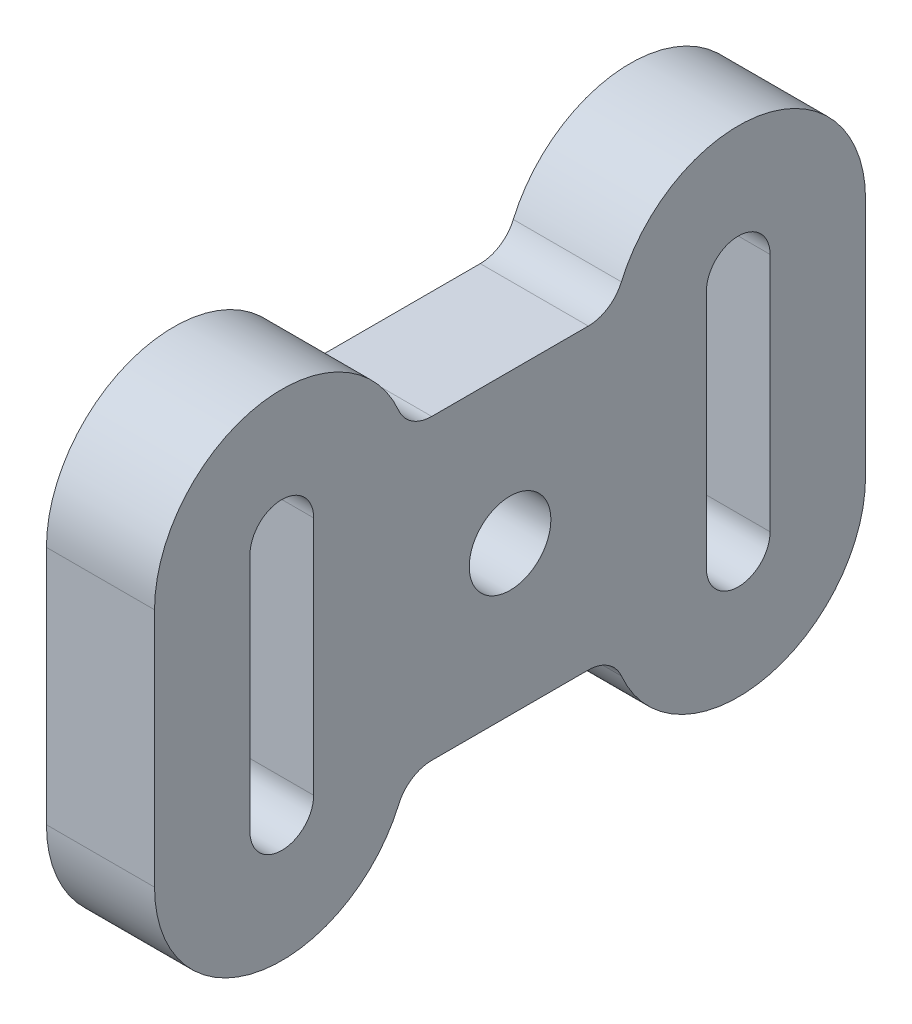
ISO-10303-21;
HEADER;
FILE_DESCRIPTION(('STEP AP214'),'2;1');
FILE_NAME('part.step','',(''),(''),'','','');
FILE_SCHEMA(('AUTOMOTIVE_DESIGN { 1 0 10303 214 1 1 1 1 }'));
ENDSEC;
DATA;
#1=APPLICATION_CONTEXT('core data for automotive mechanical design processes');
#2=APPLICATION_PROTOCOL_DEFINITION('international standard','automotive_design',2000,#1);
#3=PRODUCT_CONTEXT('',#1,'mechanical');
#4=PRODUCT('Part','Part','',(#3));
#5=PRODUCT_RELATED_PRODUCT_CATEGORY('part','',(#4));
#6=PRODUCT_DEFINITION_FORMATION('','',#4);
#7=PRODUCT_DEFINITION_CONTEXT('part definition',#1,'design');
#8=PRODUCT_DEFINITION('design','',#6,#7);
#9=PRODUCT_DEFINITION_SHAPE('','',#8);
#10=(LENGTH_UNIT() NAMED_UNIT(*) SI_UNIT(.MILLI.,.METRE.));
#11=(NAMED_UNIT(*) PLANE_ANGLE_UNIT() SI_UNIT($,.RADIAN.));
#12=(NAMED_UNIT(*) SI_UNIT($,.STERADIAN.) SOLID_ANGLE_UNIT());
#13=UNCERTAINTY_MEASURE_WITH_UNIT(LENGTH_MEASURE(1.E-05),#10,'distance_accuracy_value','');
#14=(GEOMETRIC_REPRESENTATION_CONTEXT(3) GLOBAL_UNCERTAINTY_ASSIGNED_CONTEXT((#13)) GLOBAL_UNIT_ASSIGNED_CONTEXT((#10,
#11,#12)) REPRESENTATION_CONTEXT('',''));
#15=CARTESIAN_POINT('',(0.,0.,0.));
#16=DIRECTION('',(0.,0.,1.));
#17=DIRECTION('',(1.,0.,0.));
#18=AXIS2_PLACEMENT_3D('',#15,#16,#17);
#19=CARTESIAN_POINT('',(-5.9,0.,-13.1));
#20=DIRECTION('',(1.,0.,0.));
#21=DIRECTION('',(0.,1.,0.));
#22=AXIS2_PLACEMENT_3D('',#19,#20,#21);
#23=PLANE('',#22);
#24=CARTESIAN_POINT('',(-5.9,-10.,-19.));
#25=DIRECTION('',(1.,0.,0.));
#26=DIRECTION('',(0.,0.,1.));
#27=AXIS2_PLACEMENT_3D('',#24,#25,#26);
#28=CIRCLE('',#27,2.65);
#29=CARTESIAN_POINT('',(-5.9,-10.,-16.35));
#30=VERTEX_POINT('',#29);
#31=CARTESIAN_POINT('',(-5.9,-10.,-21.65));
#32=VERTEX_POINT('',#31);
#33=EDGE_CURVE('E375',#30,#32,#28,.T.);
#34=ORIENTED_EDGE('',*,*,#33,.T.);
#35=DIRECTION('',(0.,1.,0.));
#36=VECTOR('',#35,1.);
#37=CARTESIAN_POINT('',(-5.9,0.,-21.65));
#38=LINE('',#37,#36);
#39=CARTESIAN_POINT('',(-5.9,10.,-21.65));
#40=VERTEX_POINT('',#39);
#41=EDGE_CURVE('E358',#32,#40,#38,.T.);
#42=ORIENTED_EDGE('',*,*,#41,.T.);
#43=CARTESIAN_POINT('',(-5.9,10.,-19.));
#44=DIRECTION('',(1.,0.,0.));
#45=DIRECTION('',(0.,0.,1.));
#46=AXIS2_PLACEMENT_3D('',#43,#44,#45);
#47=CIRCLE('',#46,2.65);
#48=CARTESIAN_POINT('',(-5.9,10.,-16.35));
#49=VERTEX_POINT('',#48);
#50=EDGE_CURVE('E357',#40,#49,#47,.T.);
#51=ORIENTED_EDGE('',*,*,#50,.T.);
#52=DIRECTION('',(0.,1.,0.));
#53=VECTOR('',#52,1.);
#54=CARTESIAN_POINT('',(-5.9,0.,-16.35));
#55=LINE('',#54,#53);
#56=EDGE_CURVE('E293',#30,#49,#55,.T.);
#57=ORIENTED_EDGE('',*,*,#56,.F.);
#58=EDGE_LOOP('',(#34,#42,#51,#57));
#59=FACE_BOUND('',#58,.T.);
#60=CARTESIAN_POINT('',(-5.9,10.,-19.));
#61=DIRECTION('',(1.,0.,0.));
#62=DIRECTION('',(0.,0.,1.));
#63=AXIS2_PLACEMENT_3D('',#60,#61,#62);
#64=CIRCLE('',#63,5.6);
#65=CARTESIAN_POINT('',(-5.9,10.,-24.6));
#66=VERTEX_POINT('',#65);
#67=CARTESIAN_POINT('',(-5.9,10.,-13.4));
#68=VERTEX_POINT('',#67);
#69=EDGE_CURVE('E315',#66,#68,#64,.T.);
#70=ORIENTED_EDGE('',*,*,#69,.F.);
#71=DIRECTION('',(0.,1.,0.));
#72=VECTOR('',#71,1.);
#73=CARTESIAN_POINT('',(-5.9,0.,-24.6));
#74=LINE('',#73,#72);
#75=CARTESIAN_POINT('',(-5.9,-10.,-24.6));
#76=VERTEX_POINT('',#75);
#77=EDGE_CURVE('E302',#76,#66,#74,.T.);
#78=ORIENTED_EDGE('',*,*,#77,.F.);
#79=CARTESIAN_POINT('',(-5.9,-10.,-19.));
#80=DIRECTION('',(1.,0.,0.));
#81=DIRECTION('',(0.,0.,1.));
#82=AXIS2_PLACEMENT_3D('',#79,#80,#81);
#83=CIRCLE('',#82,5.6);
#84=CARTESIAN_POINT('',(-5.9,-10.,-13.4));
#85=VERTEX_POINT('',#84);
#86=EDGE_CURVE('E28',#85,#76,#83,.T.);
#87=ORIENTED_EDGE('',*,*,#86,.F.);
#88=DIRECTION('',(0.,1.,0.));
#89=VECTOR('',#88,1.);
#90=CARTESIAN_POINT('',(-5.9,0.,-13.4));
#91=LINE('',#90,#89);
#92=EDGE_CURVE('E11',#85,#68,#91,.T.);
#93=ORIENTED_EDGE('',*,*,#92,.T.);
#94=EDGE_LOOP('',(#70,#78,#87,#93));
#95=FACE_BOUND('',#94,.T.);
#96=ADVANCED_FACE('F17',(#59,#95),#23,.F.);
#97=CARTESIAN_POINT('',(-5.9,0.,-13.4));
#98=DIRECTION('',(0.,0.,-1.));
#99=DIRECTION('',(0.,-1.,0.));
#100=AXIS2_PLACEMENT_3D('',#97,#98,#99);
#101=PLANE('',#100);
#102=DIRECTION('',(0.,1.,0.));
#103=VECTOR('',#102,1.);
#104=CARTESIAN_POINT('',(-9.,0.,-13.4));
#105=LINE('',#104,#103);
#106=CARTESIAN_POINT('',(-9.,-10.,-13.4));
#107=VERTEX_POINT('',#106);
#108=CARTESIAN_POINT('',(-9.,10.,-13.4));
#109=VERTEX_POINT('',#108);
#110=EDGE_CURVE('E346',#107,#109,#105,.T.);
#111=ORIENTED_EDGE('',*,*,#110,.T.);
#112=DIRECTION('',(-1.,0.,0.));
#113=VECTOR('',#112,1.);
#114=CARTESIAN_POINT('',(-5.9,10.,-13.4));
#115=LINE('',#114,#113);
#116=EDGE_CURVE('E318',#68,#109,#115,.T.);
#117=ORIENTED_EDGE('',*,*,#116,.F.);
#118=ORIENTED_EDGE('',*,*,#92,.F.);
#119=DIRECTION('',(-1.,0.,0.));
#120=VECTOR('',#119,1.);
#121=CARTESIAN_POINT('',(-5.9,-10.,-13.4));
#122=LINE('',#121,#120);
#123=EDGE_CURVE('E312',#85,#107,#122,.T.);
#124=ORIENTED_EDGE('',*,*,#123,.T.);
#125=EDGE_LOOP('',(#111,#117,#118,#124));
#126=FACE_BOUND('',#125,.T.);
#127=ADVANCED_FACE('F626',(#126),#101,.T.);
#128=CARTESIAN_POINT('',(-5.9,-10.,-19.));
#129=DIRECTION('',(-1.,0.,0.));
#130=DIRECTION('',(0.,0.,-1.));
#131=AXIS2_PLACEMENT_3D('',#128,#129,#130);
#132=CYLINDRICAL_SURFACE('',#131,5.6);
#133=CARTESIAN_POINT('',(-9.,-10.,-19.));
#134=DIRECTION('',(1.,0.,0.));
#135=DIRECTION('',(0.,0.,1.));
#136=AXIS2_PLACEMENT_3D('',#133,#134,#135);
#137=CIRCLE('',#136,5.6);
#138=CARTESIAN_POINT('',(-9.,-10.,-24.6));
#139=VERTEX_POINT('',#138);
#140=EDGE_CURVE('E341',#107,#139,#137,.T.);
#141=ORIENTED_EDGE('',*,*,#140,.F.);
#142=ORIENTED_EDGE('',*,*,#123,.F.);
#143=ORIENTED_EDGE('',*,*,#86,.T.);
#144=DIRECTION('',(-1.,0.,0.));
#145=VECTOR('',#144,1.);
#146=CARTESIAN_POINT('',(-5.9,-10.,-24.6));
#147=LINE('',#146,#145);
#148=EDGE_CURVE('E309',#76,#139,#147,.T.);
#149=ORIENTED_EDGE('',*,*,#148,.T.);
#150=EDGE_LOOP('',(#141,#142,#143,#149));
#151=FACE_BOUND('',#150,.T.);
#152=ADVANCED_FACE('F632',(#151),#132,.F.);
#153=CARTESIAN_POINT('',(-5.9,0.,-24.6));
#154=DIRECTION('',(0.,0.,-1.));
#155=DIRECTION('',(0.,-1.,0.));
#156=AXIS2_PLACEMENT_3D('',#153,#154,#155);
#157=PLANE('',#156);
#158=DIRECTION('',(0.,1.,0.));
#159=VECTOR('',#158,1.);
#160=CARTESIAN_POINT('',(-9.,0.,-24.6));
#161=LINE('',#160,#159);
#162=CARTESIAN_POINT('',(-9.,10.,-24.6));
#163=VERTEX_POINT('',#162);
#164=EDGE_CURVE('E345',#139,#163,#161,.T.);
#165=ORIENTED_EDGE('',*,*,#164,.F.);
#166=ORIENTED_EDGE('',*,*,#148,.F.);
#167=ORIENTED_EDGE('',*,*,#77,.T.);
#168=DIRECTION('',(-1.,0.,0.));
#169=VECTOR('',#168,1.);
#170=CARTESIAN_POINT('',(-5.9,10.,-24.6));
#171=LINE('',#170,#169);
#172=EDGE_CURVE('E307',#66,#163,#171,.T.);
#173=ORIENTED_EDGE('',*,*,#172,.T.);
#174=EDGE_LOOP('',(#165,#166,#167,#173));
#175=FACE_BOUND('',#174,.T.);
#176=ADVANCED_FACE('F305',(#175),#157,.F.);
#177=CARTESIAN_POINT('',(-5.9,10.,-19.));
#178=DIRECTION('',(-1.,0.,0.));
#179=DIRECTION('',(0.,0.,-1.));
#180=AXIS2_PLACEMENT_3D('',#177,#178,#179);
#181=CYLINDRICAL_SURFACE('',#180,5.6);
#182=CARTESIAN_POINT('',(-9.,10.,-19.));
#183=DIRECTION('',(1.,0.,0.));
#184=DIRECTION('',(0.,0.,1.));
#185=AXIS2_PLACEMENT_3D('',#182,#183,#184);
#186=CIRCLE('',#185,5.6);
#187=EDGE_CURVE('E322',#163,#109,#186,.T.);
#188=ORIENTED_EDGE('',*,*,#187,.F.);
#189=ORIENTED_EDGE('',*,*,#172,.F.);
#190=ORIENTED_EDGE('',*,*,#69,.T.);
#191=ORIENTED_EDGE('',*,*,#116,.T.);
#192=EDGE_LOOP('',(#188,#189,#190,#191));
#193=FACE_BOUND('',#192,.T.);
#194=ADVANCED_FACE('F320',(#193),#181,.F.);
#195=CARTESIAN_POINT('',(-9.,0.,-16.35));
#196=DIRECTION('',(0.,0.,1.));
#197=DIRECTION('',(1.,0.,0.));
#198=AXIS2_PLACEMENT_3D('',#195,#196,#197);
#199=PLANE('',#198);
#200=DIRECTION('',(1.,0.,0.));
#201=VECTOR('',#200,1.);
#202=CARTESIAN_POINT('',(-9.,10.,-16.35));
#203=LINE('',#202,#201);
#204=CARTESIAN_POINT('',(0.,10.,-16.35));
#205=VERTEX_POINT('',#204);
#206=EDGE_CURVE('E404',#49,#205,#203,.T.);
#207=ORIENTED_EDGE('',*,*,#206,.T.);
#208=DIRECTION('',(0.,1.,0.));
#209=VECTOR('',#208,1.);
#210=CARTESIAN_POINT('',(0.,0.,-16.35));
#211=LINE('',#210,#209);
#212=CARTESIAN_POINT('',(0.,-10.,-16.35));
#213=VERTEX_POINT('',#212);
#214=EDGE_CURVE('E428',#213,#205,#211,.T.);
#215=ORIENTED_EDGE('',*,*,#214,.F.);
#216=DIRECTION('',(1.,0.,0.));
#217=VECTOR('',#216,1.);
#218=CARTESIAN_POINT('',(-9.,-10.,-16.35));
#219=LINE('',#218,#217);
#220=EDGE_CURVE('E371',#30,#213,#219,.T.);
#221=ORIENTED_EDGE('',*,*,#220,.F.);
#222=ORIENTED_EDGE('',*,*,#56,.T.);
#223=EDGE_LOOP('',(#207,#215,#221,#222));
#224=FACE_BOUND('',#223,.T.);
#225=ADVANCED_FACE('F621',(#224),#199,.F.);
#226=CARTESIAN_POINT('',(-9.,-15.4,-6.51801297869606));
#227=DIRECTION('',(1.,0.,0.));
#228=DIRECTION('',(0.,0.,1.));
#229=AXIS2_PLACEMENT_3D('',#226,#227,#228);
#230=CYLINDRICAL_SURFACE('',#229,3.);
#231=CARTESIAN_POINT('',(0.,-15.4,-6.51801297869606));
#232=DIRECTION('',(1.,0.,0.));
#233=DIRECTION('',(0.,0.,1.));
#234=AXIS2_PLACEMENT_3D('',#231,#232,#233);
#235=CIRCLE('',#234,3.);
#236=CARTESIAN_POINT('',(0.,-14.2088235294118,-9.27139246868958));
#237=VERTEX_POINT('',#236);
#238=CARTESIAN_POINT('',(0.,-12.4,-6.51801297869606));
#239=VERTEX_POINT('',#238);
#240=EDGE_CURVE('E266',#237,#239,#235,.T.);
#241=ORIENTED_EDGE('',*,*,#240,.T.);
#242=DIRECTION('',(1.,0.,0.));
#243=VECTOR('',#242,1.);
#244=CARTESIAN_POINT('',(-9.,-12.4,-6.51801297869606));
#245=LINE('',#244,#243);
#246=CARTESIAN_POINT('',(-9.,-12.4,-6.51801297869606));
#247=VERTEX_POINT('',#246);
#248=EDGE_CURVE('E340',#247,#239,#245,.T.);
#249=ORIENTED_EDGE('',*,*,#248,.F.);
#250=CARTESIAN_POINT('',(-9.,-15.4,-6.51801297869606));
#251=DIRECTION('',(1.,0.,0.));
#252=DIRECTION('',(0.,0.,1.));
#253=AXIS2_PLACEMENT_3D('',#250,#251,#252);
#254=CIRCLE('',#253,3.);
#255=CARTESIAN_POINT('',(-9.,-14.2088235294118,-9.27139246868958));
#256=VERTEX_POINT('',#255);
#257=EDGE_CURVE('E256',#256,#247,#254,.T.);
#258=ORIENTED_EDGE('',*,*,#257,.F.);
#259=DIRECTION('',(1.,0.,0.));
#260=VECTOR('',#259,1.);
#261=CARTESIAN_POINT('',(-9.,-14.2088235294118,-9.27139246868958));
#262=LINE('',#261,#260);
#263=EDGE_CURVE('E330',#256,#237,#262,.T.);
#264=ORIENTED_EDGE('',*,*,#263,.T.);
#265=EDGE_LOOP('',(#241,#249,#258,#264));
#266=FACE_BOUND('',#265,.T.);
#267=ADVANCED_FACE('F19',(#266),#230,.F.);
#268=CARTESIAN_POINT('',(-9.,-10.,-19.));
#269=DIRECTION('',(1.,0.,0.));
#270=DIRECTION('',(0.,0.,1.));
#271=AXIS2_PLACEMENT_3D('',#268,#269,#270);
#272=CYLINDRICAL_SURFACE('',#271,10.6);
#273=CARTESIAN_POINT('',(0.,-10.,-19.));
#274=DIRECTION('',(-1.,0.,0.));
#275=DIRECTION('',(0.,0.,1.));
#276=AXIS2_PLACEMENT_3D('',#273,#274,#275);
#277=CIRCLE('',#276,10.6);
#278=CARTESIAN_POINT('',(0.,-10.,-29.6));
#279=VERTEX_POINT('',#278);
#280=EDGE_CURVE('E446',#279,#237,#277,.T.);
#281=ORIENTED_EDGE('',*,*,#280,.T.);
#282=ORIENTED_EDGE('',*,*,#263,.F.);
#283=CARTESIAN_POINT('',(-9.,-10.,-19.));
#284=DIRECTION('',(-1.,0.,0.));
#285=DIRECTION('',(0.,0.,1.));
#286=AXIS2_PLACEMENT_3D('',#283,#284,#285);
#287=CIRCLE('',#286,10.6);
#288=CARTESIAN_POINT('',(-9.,-10.,-29.6));
#289=VERTEX_POINT('',#288);
#290=EDGE_CURVE('E456',#289,#256,#287,.T.);
#291=ORIENTED_EDGE('',*,*,#290,.F.);
#292=DIRECTION('',(1.,0.,0.));
#293=VECTOR('',#292,1.);
#294=CARTESIAN_POINT('',(-9.,-10.,-29.6));
#295=LINE('',#294,#293);
#296=EDGE_CURVE('E452',#289,#279,#295,.T.);
#297=ORIENTED_EDGE('',*,*,#296,.T.);
#298=EDGE_LOOP('',(#281,#282,#291,#297));
#299=FACE_BOUND('',#298,.T.);
#300=ADVANCED_FACE('F670',(#299),#272,.T.);
#301=CARTESIAN_POINT('',(-9.,0.,-29.6));
#302=DIRECTION('',(0.,0.,-1.));
#303=DIRECTION('',(0.,-1.,0.));
#304=AXIS2_PLACEMENT_3D('',#301,#302,#303);
#305=PLANE('',#304);
#306=DIRECTION('',(0.,-1.,0.));
#307=VECTOR('',#306,1.);
#308=CARTESIAN_POINT('',(0.,0.,-29.6));
#309=LINE('',#308,#307);
#310=CARTESIAN_POINT('',(0.,10.,-29.6));
#311=VERTEX_POINT('',#310);
#312=EDGE_CURVE('E434',#311,#279,#309,.T.);
#313=ORIENTED_EDGE('',*,*,#312,.T.);
#314=ORIENTED_EDGE('',*,*,#296,.F.);
#315=DIRECTION('',(0.,-1.,0.));
#316=VECTOR('',#315,1.);
#317=CARTESIAN_POINT('',(-9.,0.,-29.6));
#318=LINE('',#317,#316);
#319=CARTESIAN_POINT('',(-9.,10.,-29.6));
#320=VERTEX_POINT('',#319);
#321=EDGE_CURVE('E482',#320,#289,#318,.T.);
#322=ORIENTED_EDGE('',*,*,#321,.F.);
#323=DIRECTION('',(1.,0.,0.));
#324=VECTOR('',#323,1.);
#325=CARTESIAN_POINT('',(-9.,10.,-29.6));
#326=LINE('',#325,#324);
#327=EDGE_CURVE('E449',#320,#311,#326,.T.);
#328=ORIENTED_EDGE('',*,*,#327,.T.);
#329=EDGE_LOOP('',(#313,#314,#322,#328));
#330=FACE_BOUND('',#329,.T.);
#331=ADVANCED_FACE('F657',(#330),#305,.T.);
#332=CARTESIAN_POINT('',(-9.,10.,-19.));
#333=DIRECTION('',(1.,0.,0.));
#334=DIRECTION('',(0.,0.,1.));
#335=AXIS2_PLACEMENT_3D('',#332,#333,#334);
#336=CYLINDRICAL_SURFACE('',#335,10.6);
#337=CARTESIAN_POINT('',(0.,10.,-19.));
#338=DIRECTION('',(-1.,0.,0.));
#339=DIRECTION('',(0.,0.,1.));
#340=AXIS2_PLACEMENT_3D('',#337,#338,#339);
#341=CIRCLE('',#340,10.6);
#342=CARTESIAN_POINT('',(0.,14.2088235294118,-9.27139246868958));
#343=VERTEX_POINT('',#342);
#344=EDGE_CURVE('E429',#343,#311,#341,.T.);
#345=ORIENTED_EDGE('',*,*,#344,.T.);
#346=ORIENTED_EDGE('',*,*,#327,.F.);
#347=CARTESIAN_POINT('',(-9.,10.,-19.));
#348=DIRECTION('',(-1.,0.,0.));
#349=DIRECTION('',(0.,0.,1.));
#350=AXIS2_PLACEMENT_3D('',#347,#348,#349);
#351=CIRCLE('',#350,10.6);
#352=CARTESIAN_POINT('',(-9.,14.2088235294118,-9.27139246868958));
#353=VERTEX_POINT('',#352);
#354=EDGE_CURVE('E463',#353,#320,#351,.T.);
#355=ORIENTED_EDGE('',*,*,#354,.F.);
#356=DIRECTION('',(1.,0.,0.));
#357=VECTOR('',#356,1.);
#358=CARTESIAN_POINT('',(-9.,14.2088235294118,-9.27139246868958));
#359=LINE('',#358,#357);
#360=EDGE_CURVE('E406',#353,#343,#359,.T.);
#361=ORIENTED_EDGE('',*,*,#360,.T.);
#362=EDGE_LOOP('',(#345,#346,#355,#361));
#363=FACE_BOUND('',#362,.T.);
#364=ADVANCED_FACE('F653',(#363),#336,.T.);
#365=CARTESIAN_POINT('',(-9.,15.4,-6.51801297869606));
#366=DIRECTION('',(1.,0.,0.));
#367=DIRECTION('',(0.,0.,1.));
#368=AXIS2_PLACEMENT_3D('',#365,#366,#367);
#369=CYLINDRICAL_SURFACE('',#368,3.);
#370=CARTESIAN_POINT('',(0.,15.4,-6.51801297869606));
#371=DIRECTION('',(-1.,0.,0.));
#372=DIRECTION('',(0.,0.,1.));
#373=AXIS2_PLACEMENT_3D('',#370,#371,#372);
#374=CIRCLE('',#373,3.);
#375=CARTESIAN_POINT('',(0.,12.4,-6.51801297869606));
#376=VERTEX_POINT('',#375);
#377=EDGE_CURVE('E433',#343,#376,#374,.T.);
#378=ORIENTED_EDGE('',*,*,#377,.F.);
#379=ORIENTED_EDGE('',*,*,#360,.F.);
#380=CARTESIAN_POINT('',(-9.,15.4,-6.51801297869606));
#381=DIRECTION('',(-1.,0.,0.));
#382=DIRECTION('',(0.,0.,1.));
#383=AXIS2_PLACEMENT_3D('',#380,#381,#382);
#384=CIRCLE('',#383,3.);
#385=CARTESIAN_POINT('',(-9.,12.4,-6.51801297869606));
#386=VERTEX_POINT('',#385);
#387=EDGE_CURVE('E349',#353,#386,#384,.T.);
#388=ORIENTED_EDGE('',*,*,#387,.T.);
#389=DIRECTION('',(1.,0.,0.));
#390=VECTOR('',#389,1.);
#391=CARTESIAN_POINT('',(-9.,12.4,-6.51801297869606));
#392=LINE('',#391,#390);
#393=EDGE_CURVE('E393',#386,#376,#392,.T.);
#394=ORIENTED_EDGE('',*,*,#393,.T.);
#395=EDGE_LOOP('',(#378,#379,#388,#394));
#396=FACE_BOUND('',#395,.T.);
#397=ADVANCED_FACE('F656',(#396),#369,.F.);
#398=CARTESIAN_POINT('',(-9.,10.,-19.));
#399=DIRECTION('',(1.,0.,0.));
#400=DIRECTION('',(0.,0.,1.));
#401=AXIS2_PLACEMENT_3D('',#398,#399,#400);
#402=CYLINDRICAL_SURFACE('',#401,2.65);
#403=ORIENTED_EDGE('',*,*,#50,.F.);
#404=DIRECTION('',(1.,0.,0.));
#405=VECTOR('',#404,1.);
#406=CARTESIAN_POINT('',(-9.,10.,-21.65));
#407=LINE('',#406,#405);
#408=CARTESIAN_POINT('',(0.,10.,-21.65));
#409=VERTEX_POINT('',#408);
#410=EDGE_CURVE('E354',#40,#409,#407,.T.);
#411=ORIENTED_EDGE('',*,*,#410,.T.);
#412=CARTESIAN_POINT('',(0.,10.,-19.));
#413=DIRECTION('',(1.,0.,0.));
#414=DIRECTION('',(0.,0.,1.));
#415=AXIS2_PLACEMENT_3D('',#412,#413,#414);
#416=CIRCLE('',#415,2.65);
#417=EDGE_CURVE('E423',#409,#205,#416,.T.);
#418=ORIENTED_EDGE('',*,*,#417,.T.);
#419=ORIENTED_EDGE('',*,*,#206,.F.);
#420=EDGE_LOOP('',(#403,#411,#418,#419));
#421=FACE_BOUND('',#420,.T.);
#422=ADVANCED_FACE('F623',(#421),#402,.F.);
#423=CARTESIAN_POINT('',(-9.,0.,-21.65));
#424=DIRECTION('',(0.,0.,1.));
#425=DIRECTION('',(1.,0.,0.));
#426=AXIS2_PLACEMENT_3D('',#423,#424,#425);
#427=PLANE('',#426);
#428=ORIENTED_EDGE('',*,*,#41,.F.);
#429=DIRECTION('',(1.,0.,0.));
#430=VECTOR('',#429,1.);
#431=CARTESIAN_POINT('',(-9.,-10.,-21.65));
#432=LINE('',#431,#430);
#433=CARTESIAN_POINT('',(0.,-10.,-21.65));
#434=VERTEX_POINT('',#433);
#435=EDGE_CURVE('E374',#32,#434,#432,.T.);
#436=ORIENTED_EDGE('',*,*,#435,.T.);
#437=DIRECTION('',(0.,1.,0.));
#438=VECTOR('',#437,1.);
#439=CARTESIAN_POINT('',(0.,0.,-21.65));
#440=LINE('',#439,#438);
#441=EDGE_CURVE('E427',#434,#409,#440,.T.);
#442=ORIENTED_EDGE('',*,*,#441,.T.);
#443=ORIENTED_EDGE('',*,*,#410,.F.);
#444=EDGE_LOOP('',(#428,#436,#442,#443));
#445=FACE_BOUND('',#444,.T.);
#446=ADVANCED_FACE('F611',(#445),#427,.T.);
#447=CARTESIAN_POINT('',(-9.,-10.,-19.));
#448=DIRECTION('',(1.,0.,0.));
#449=DIRECTION('',(0.,0.,1.));
#450=AXIS2_PLACEMENT_3D('',#447,#448,#449);
#451=CYLINDRICAL_SURFACE('',#450,2.65);
#452=ORIENTED_EDGE('',*,*,#33,.F.);
#453=ORIENTED_EDGE('',*,*,#220,.T.);
#454=CARTESIAN_POINT('',(0.,-10.,-19.));
#455=DIRECTION('',(1.,0.,0.));
#456=DIRECTION('',(0.,0.,1.));
#457=AXIS2_PLACEMENT_3D('',#454,#455,#456);
#458=CIRCLE('',#457,2.65);
#459=EDGE_CURVE('E457',#213,#434,#458,.T.);
#460=ORIENTED_EDGE('',*,*,#459,.T.);
#461=ORIENTED_EDGE('',*,*,#435,.F.);
#462=EDGE_LOOP('',(#452,#453,#460,#461));
#463=FACE_BOUND('',#462,.T.);
#464=ADVANCED_FACE('F619',(#463),#451,.F.);
#465=CARTESIAN_POINT('',(-5.9,0.,13.1));
#466=DIRECTION('',(1.,0.,0.));
#467=DIRECTION('',(0.,1.,0.));
#468=AXIS2_PLACEMENT_3D('',#465,#466,#467);
#469=PLANE('',#468);
#470=CARTESIAN_POINT('',(-5.9,-10.,19.));
#471=DIRECTION('',(-1.,0.,0.));
#472=DIRECTION('',(0.,0.,-1.));
#473=AXIS2_PLACEMENT_3D('',#470,#471,#472);
#474=CIRCLE('',#473,2.65);
#475=CARTESIAN_POINT('',(-5.9,-10.,16.35));
#476=VERTEX_POINT('',#475);
#477=CARTESIAN_POINT('',(-5.9,-10.,21.65));
#478=VERTEX_POINT('',#477);
#479=EDGE_CURVE('E387',#476,#478,#474,.T.);
#480=ORIENTED_EDGE('',*,*,#479,.F.);
#481=DIRECTION('',(0.,1.,0.));
#482=VECTOR('',#481,1.);
#483=CARTESIAN_POINT('',(-5.9,0.,16.35));
#484=LINE('',#483,#482);
#485=CARTESIAN_POINT('',(-5.9,10.,16.35));
#486=VERTEX_POINT('',#485);
#487=EDGE_CURVE('E336',#476,#486,#484,.T.);
#488=ORIENTED_EDGE('',*,*,#487,.T.);
#489=CARTESIAN_POINT('',(-5.9,10.,19.));
#490=DIRECTION('',(-1.,0.,0.));
#491=DIRECTION('',(0.,0.,-1.));
#492=AXIS2_PLACEMENT_3D('',#489,#490,#491);
#493=CIRCLE('',#492,2.65);
#494=CARTESIAN_POINT('',(-5.9,10.,21.65));
#495=VERTEX_POINT('',#494);
#496=EDGE_CURVE('E490',#495,#486,#493,.T.);
#497=ORIENTED_EDGE('',*,*,#496,.F.);
#498=DIRECTION('',(0.,1.,0.));
#499=VECTOR('',#498,1.);
#500=CARTESIAN_POINT('',(-5.9,0.,21.65));
#501=LINE('',#500,#499);
#502=EDGE_CURVE('E437',#478,#495,#501,.T.);
#503=ORIENTED_EDGE('',*,*,#502,.F.);
#504=EDGE_LOOP('',(#480,#488,#497,#503));
#505=FACE_BOUND('',#504,.T.);
#506=CARTESIAN_POINT('',(-5.9,10.,19.));
#507=DIRECTION('',(-1.,0.,0.));
#508=DIRECTION('',(0.,0.,-1.));
#509=AXIS2_PLACEMENT_3D('',#506,#507,#508);
#510=CIRCLE('',#509,5.6);
#511=CARTESIAN_POINT('',(-5.9,10.,24.6));
#512=VERTEX_POINT('',#511);
#513=CARTESIAN_POINT('',(-5.9,10.,13.4));
#514=VERTEX_POINT('',#513);
#515=EDGE_CURVE('E416',#512,#514,#510,.T.);
#516=ORIENTED_EDGE('',*,*,#515,.T.);
#517=DIRECTION('',(0.,1.,0.));
#518=VECTOR('',#517,1.);
#519=CARTESIAN_POINT('',(-5.9,0.,13.4));
#520=LINE('',#519,#518);
#521=CARTESIAN_POINT('',(-5.9,-10.,13.4));
#522=VERTEX_POINT('',#521);
#523=EDGE_CURVE('E353',#522,#514,#520,.T.);
#524=ORIENTED_EDGE('',*,*,#523,.F.);
#525=CARTESIAN_POINT('',(-5.9,-10.,19.));
#526=DIRECTION('',(-1.,0.,0.));
#527=DIRECTION('',(0.,0.,-1.));
#528=AXIS2_PLACEMENT_3D('',#525,#526,#527);
#529=CIRCLE('',#528,5.6);
#530=CARTESIAN_POINT('',(-5.9,-10.,24.6));
#531=VERTEX_POINT('',#530);
#532=EDGE_CURVE('E199',#522,#531,#529,.T.);
#533=ORIENTED_EDGE('',*,*,#532,.T.);
#534=DIRECTION('',(0.,1.,0.));
#535=VECTOR('',#534,1.);
#536=CARTESIAN_POINT('',(-5.9,0.,24.6));
#537=LINE('',#536,#535);
#538=EDGE_CURVE('E208',#531,#512,#537,.T.);
#539=ORIENTED_EDGE('',*,*,#538,.T.);
#540=EDGE_LOOP('',(#516,#524,#533,#539));
#541=FACE_BOUND('',#540,.T.);
#542=ADVANCED_FACE('F692',(#505,#541),#469,.F.);
#543=CARTESIAN_POINT('',(-5.9,0.,13.4));
#544=DIRECTION('',(0.,0.,1.));
#545=DIRECTION('',(1.,0.,0.));
#546=AXIS2_PLACEMENT_3D('',#543,#544,#545);
#547=PLANE('',#546);
#548=DIRECTION('',(0.,1.,0.));
#549=VECTOR('',#548,1.);
#550=CARTESIAN_POINT('',(-9.,0.,13.4));
#551=LINE('',#550,#549);
#552=CARTESIAN_POINT('',(-9.,-10.,13.4));
#553=VERTEX_POINT('',#552);
#554=CARTESIAN_POINT('',(-9.,10.,13.4));
#555=VERTEX_POINT('',#554);
#556=EDGE_CURVE('E370',#553,#555,#551,.T.);
#557=ORIENTED_EDGE('',*,*,#556,.F.);
#558=DIRECTION('',(-1.,0.,0.));
#559=VECTOR('',#558,1.);
#560=CARTESIAN_POINT('',(-5.9,-10.,13.4));
#561=LINE('',#560,#559);
#562=EDGE_CURVE('E350',#522,#553,#561,.T.);
#563=ORIENTED_EDGE('',*,*,#562,.F.);
#564=ORIENTED_EDGE('',*,*,#523,.T.);
#565=DIRECTION('',(-1.,0.,0.));
#566=VECTOR('',#565,1.);
#567=CARTESIAN_POINT('',(-5.9,10.,13.4));
#568=LINE('',#567,#566);
#569=EDGE_CURVE('E420',#514,#555,#568,.T.);
#570=ORIENTED_EDGE('',*,*,#569,.T.);
#571=EDGE_LOOP('',(#557,#563,#564,#570));
#572=FACE_BOUND('',#571,.T.);
#573=ADVANCED_FACE('F688',(#572),#547,.T.);
#574=CARTESIAN_POINT('',(-5.9,-10.,19.));
#575=DIRECTION('',(-1.,0.,0.));
#576=DIRECTION('',(0.,0.,1.));
#577=AXIS2_PLACEMENT_3D('',#574,#575,#576);
#578=CYLINDRICAL_SURFACE('',#577,5.6);
#579=CARTESIAN_POINT('',(-9.,-10.,19.));
#580=DIRECTION('',(-1.,0.,0.));
#581=DIRECTION('',(0.,0.,-1.));
#582=AXIS2_PLACEMENT_3D('',#579,#580,#581);
#583=CIRCLE('',#582,5.6);
#584=CARTESIAN_POINT('',(-9.,-10.,24.6));
#585=VERTEX_POINT('',#584);
#586=EDGE_CURVE('E497',#553,#585,#583,.T.);
#587=ORIENTED_EDGE('',*,*,#586,.T.);
#588=DIRECTION('',(-1.,0.,0.));
#589=VECTOR('',#588,1.);
#590=CARTESIAN_POINT('',(-5.9,-10.,24.6));
#591=LINE('',#590,#589);
#592=EDGE_CURVE('E398',#531,#585,#591,.T.);
#593=ORIENTED_EDGE('',*,*,#592,.F.);
#594=ORIENTED_EDGE('',*,*,#532,.F.);
#595=ORIENTED_EDGE('',*,*,#562,.T.);
#596=EDGE_LOOP('',(#587,#593,#594,#595));
#597=FACE_BOUND('',#596,.T.);
#598=ADVANCED_FACE('F691',(#597),#578,.F.);
#599=CARTESIAN_POINT('',(-5.9,0.,24.6));
#600=DIRECTION('',(0.,0.,1.));
#601=DIRECTION('',(1.,0.,0.));
#602=AXIS2_PLACEMENT_3D('',#599,#600,#601);
#603=PLANE('',#602);
#604=DIRECTION('',(0.,1.,0.));
#605=VECTOR('',#604,1.);
#606=CARTESIAN_POINT('',(-9.,0.,24.6));
#607=LINE('',#606,#605);
#608=CARTESIAN_POINT('',(-9.,10.,24.6));
#609=VERTEX_POINT('',#608);
#610=EDGE_CURVE('E369',#585,#609,#607,.T.);
#611=ORIENTED_EDGE('',*,*,#610,.T.);
#612=DIRECTION('',(-1.,0.,0.));
#613=VECTOR('',#612,1.);
#614=CARTESIAN_POINT('',(-5.9,10.,24.6));
#615=LINE('',#614,#613);
#616=EDGE_CURVE('E419',#512,#609,#615,.T.);
#617=ORIENTED_EDGE('',*,*,#616,.F.);
#618=ORIENTED_EDGE('',*,*,#538,.F.);
#619=ORIENTED_EDGE('',*,*,#592,.T.);
#620=EDGE_LOOP('',(#611,#617,#618,#619));
#621=FACE_BOUND('',#620,.T.);
#622=ADVANCED_FACE('F681',(#621),#603,.F.);
#623=CARTESIAN_POINT('',(-5.9,10.,19.));
#624=DIRECTION('',(-1.,0.,0.));
#625=DIRECTION('',(0.,0.,1.));
#626=AXIS2_PLACEMENT_3D('',#623,#624,#625);
#627=CYLINDRICAL_SURFACE('',#626,5.6);
#628=CARTESIAN_POINT('',(-9.,10.,19.));
#629=DIRECTION('',(-1.,0.,0.));
#630=DIRECTION('',(0.,0.,-1.));
#631=AXIS2_PLACEMENT_3D('',#628,#629,#630);
#632=CIRCLE('',#631,5.6);
#633=EDGE_CURVE('E365',#609,#555,#632,.T.);
#634=ORIENTED_EDGE('',*,*,#633,.T.);
#635=ORIENTED_EDGE('',*,*,#569,.F.);
#636=ORIENTED_EDGE('',*,*,#515,.F.);
#637=ORIENTED_EDGE('',*,*,#616,.T.);
#638=EDGE_LOOP('',(#634,#635,#636,#637));
#639=FACE_BOUND('',#638,.T.);
#640=ADVANCED_FACE('F667',(#639),#627,.F.);
#641=CARTESIAN_POINT('',(0.,0.,13.1));
#642=DIRECTION('',(1.,0.,0.));
#643=DIRECTION('',(0.,1.,0.));
#644=AXIS2_PLACEMENT_3D('',#641,#642,#643);
#645=PLANE('',#644);
#646=ORIENTED_EDGE('',*,*,#459,.F.);
#647=ORIENTED_EDGE('',*,*,#214,.T.);
#648=ORIENTED_EDGE('',*,*,#417,.F.);
#649=ORIENTED_EDGE('',*,*,#441,.F.);
#650=EDGE_LOOP('',(#646,#647,#648,#649));
#651=FACE_BOUND('',#650,.T.);
#652=CARTESIAN_POINT('',(0.,-10.,19.));
#653=DIRECTION('',(-1.,0.,0.));
#654=DIRECTION('',(0.,0.,-1.));
#655=AXIS2_PLACEMENT_3D('',#652,#653,#654);
#656=CIRCLE('',#655,2.65);
#657=CARTESIAN_POINT('',(0.,-10.,16.35));
#658=VERTEX_POINT('',#657);
#659=CARTESIAN_POINT('',(0.,-10.,21.65));
#660=VERTEX_POINT('',#659);
#661=EDGE_CURVE('E386',#658,#660,#656,.T.);
#662=ORIENTED_EDGE('',*,*,#661,.T.);
#663=DIRECTION('',(0.,1.,0.));
#664=VECTOR('',#663,1.);
#665=CARTESIAN_POINT('',(0.,0.,21.65));
#666=LINE('',#665,#664);
#667=CARTESIAN_POINT('',(0.,10.,21.65));
#668=VERTEX_POINT('',#667);
#669=EDGE_CURVE('E486',#660,#668,#666,.T.);
#670=ORIENTED_EDGE('',*,*,#669,.T.);
#671=CARTESIAN_POINT('',(0.,10.,19.));
#672=DIRECTION('',(-1.,0.,0.));
#673=DIRECTION('',(0.,0.,-1.));
#674=AXIS2_PLACEMENT_3D('',#671,#672,#673);
#675=CIRCLE('',#674,2.65);
#676=CARTESIAN_POINT('',(0.,10.,16.35));
#677=VERTEX_POINT('',#676);
#678=EDGE_CURVE('E540',#668,#677,#675,.T.);
#679=ORIENTED_EDGE('',*,*,#678,.T.);
#680=DIRECTION('',(0.,1.,0.));
#681=VECTOR('',#680,1.);
#682=CARTESIAN_POINT('',(0.,0.,16.35));
#683=LINE('',#682,#681);
#684=EDGE_CURVE('E339',#658,#677,#683,.T.);
#685=ORIENTED_EDGE('',*,*,#684,.F.);
#686=EDGE_LOOP('',(#662,#670,#679,#685));
#687=FACE_BOUND('',#686,.T.);
#688=CARTESIAN_POINT('',(0.,0.,0.));
#689=DIRECTION('',(1.,0.,0.));
#690=DIRECTION('',(0.,0.,-1.));
#691=AXIS2_PLACEMENT_3D('',#688,#689,#690);
#692=CIRCLE('',#691,3.4);
#693=CARTESIAN_POINT('',(0.,0.,-3.4));
#694=VERTEX_POINT('',#693);
#695=EDGE_CURVE('E466',#694,#694,#692,.T.);
#696=ORIENTED_EDGE('',*,*,#695,.F.);
#697=EDGE_LOOP('',(#696));
#698=FACE_BOUND('',#697,.T.);
#699=DIRECTION('',(0.,0.,-1.));
#700=VECTOR('',#699,1.);
#701=CARTESIAN_POINT('',(0.,-12.4,3.25900648934803));
#702=LINE('',#701,#700);
#703=CARTESIAN_POINT('',(0.,-12.4,6.51801297869606));
#704=VERTEX_POINT('',#703);
#705=EDGE_CURVE('E476',#704,#239,#702,.T.);
#706=ORIENTED_EDGE('',*,*,#705,.T.);
#707=ORIENTED_EDGE('',*,*,#240,.F.);
#708=ORIENTED_EDGE('',*,*,#280,.F.);
#709=ORIENTED_EDGE('',*,*,#312,.F.);
#710=ORIENTED_EDGE('',*,*,#344,.F.);
#711=ORIENTED_EDGE('',*,*,#377,.T.);
#712=DIRECTION('',(0.,0.,-1.));
#713=VECTOR('',#712,1.);
#714=CARTESIAN_POINT('',(0.,12.4,3.25900648934803));
#715=LINE('',#714,#713);
#716=CARTESIAN_POINT('',(0.,12.4,6.51801297869606));
#717=VERTEX_POINT('',#716);
#718=EDGE_CURVE('E408',#717,#376,#715,.T.);
#719=ORIENTED_EDGE('',*,*,#718,.F.);
#720=CARTESIAN_POINT('',(0.,15.4,6.51801297869606));
#721=DIRECTION('',(1.,0.,0.));
#722=DIRECTION('',(0.,0.,-1.));
#723=AXIS2_PLACEMENT_3D('',#720,#721,#722);
#724=CIRCLE('',#723,3.);
#725=CARTESIAN_POINT('',(0.,14.2088235294118,9.27139246868958));
#726=VERTEX_POINT('',#725);
#727=EDGE_CURVE('E175',#726,#717,#724,.T.);
#728=ORIENTED_EDGE('',*,*,#727,.F.);
#729=CARTESIAN_POINT('',(0.,10.,19.));
#730=DIRECTION('',(1.,0.,0.));
#731=DIRECTION('',(0.,0.,-1.));
#732=AXIS2_PLACEMENT_3D('',#729,#730,#731);
#733=CIRCLE('',#732,10.6);
#734=CARTESIAN_POINT('',(0.,10.,29.6));
#735=VERTEX_POINT('',#734);
#736=EDGE_CURVE('E415',#726,#735,#733,.T.);
#737=ORIENTED_EDGE('',*,*,#736,.T.);
#738=DIRECTION('',(0.,-1.,0.));
#739=VECTOR('',#738,1.);
#740=CARTESIAN_POINT('',(0.,0.,29.6));
#741=LINE('',#740,#739);
#742=CARTESIAN_POINT('',(0.,-10.,29.6));
#743=VERTEX_POINT('',#742);
#744=EDGE_CURVE('E334',#735,#743,#741,.T.);
#745=ORIENTED_EDGE('',*,*,#744,.T.);
#746=CARTESIAN_POINT('',(0.,-10.,19.));
#747=DIRECTION('',(1.,0.,0.));
#748=DIRECTION('',(0.,0.,-1.));
#749=AXIS2_PLACEMENT_3D('',#746,#747,#748);
#750=CIRCLE('',#749,10.6);
#751=CARTESIAN_POINT('',(0.,-14.2088235294118,9.27139246868958));
#752=VERTEX_POINT('',#751);
#753=EDGE_CURVE('E363',#743,#752,#750,.T.);
#754=ORIENTED_EDGE('',*,*,#753,.T.);
#755=CARTESIAN_POINT('',(0.,-15.4,6.51801297869606));
#756=DIRECTION('',(-1.,0.,0.));
#757=DIRECTION('',(0.,0.,-1.));
#758=AXIS2_PLACEMENT_3D('',#755,#756,#757);
#759=CIRCLE('',#758,3.);
#760=EDGE_CURVE('E376',#752,#704,#759,.T.);
#761=ORIENTED_EDGE('',*,*,#760,.T.);
#762=EDGE_LOOP('',(#706,#707,#708,#709,#710,#711,#719,#728,#737,#745,#754,#761));
#763=FACE_BOUND('',#762,.T.);
#764=ADVANCED_FACE('F618',(#651,#687,#698,#763),#645,.T.);
#765=CARTESIAN_POINT('',(-9.,0.,13.1));
#766=DIRECTION('',(1.,0.,0.));
#767=DIRECTION('',(0.,1.,0.));
#768=AXIS2_PLACEMENT_3D('',#765,#766,#767);
#769=PLANE('',#768);
#770=ORIENTED_EDGE('',*,*,#110,.F.);
#771=ORIENTED_EDGE('',*,*,#140,.T.);
#772=ORIENTED_EDGE('',*,*,#164,.T.);
#773=ORIENTED_EDGE('',*,*,#187,.T.);
#774=EDGE_LOOP('',(#770,#771,#772,#773));
#775=FACE_BOUND('',#774,.T.);
#776=CARTESIAN_POINT('',(-9.,0.,0.));
#777=DIRECTION('',(1.,0.,0.));
#778=DIRECTION('',(0.,0.,-1.));
#779=AXIS2_PLACEMENT_3D('',#776,#777,#778);
#780=CIRCLE('',#779,3.4);
#781=CARTESIAN_POINT('',(-9.,0.,-3.4));
#782=VERTEX_POINT('',#781);
#783=EDGE_CURVE('E164',#782,#782,#780,.T.);
#784=ORIENTED_EDGE('',*,*,#783,.T.);
#785=EDGE_LOOP('',(#784));
#786=FACE_BOUND('',#785,.T.);
#787=ORIENTED_EDGE('',*,*,#556,.T.);
#788=ORIENTED_EDGE('',*,*,#633,.F.);
#789=ORIENTED_EDGE('',*,*,#610,.F.);
#790=ORIENTED_EDGE('',*,*,#586,.F.);
#791=EDGE_LOOP('',(#787,#788,#789,#790));
#792=FACE_BOUND('',#791,.T.);
#793=ORIENTED_EDGE('',*,*,#257,.T.);
#794=DIRECTION('',(0.,0.,-1.));
#795=VECTOR('',#794,1.);
#796=CARTESIAN_POINT('',(-9.,-12.4,3.25900648934803));
#797=LINE('',#796,#795);
#798=CARTESIAN_POINT('',(-9.,-12.4,6.51801297869606));
#799=VERTEX_POINT('',#798);
#800=EDGE_CURVE('E532',#799,#247,#797,.T.);
#801=ORIENTED_EDGE('',*,*,#800,.F.);
#802=CARTESIAN_POINT('',(-9.,-15.4,6.51801297869606));
#803=DIRECTION('',(-1.,0.,0.));
#804=DIRECTION('',(0.,0.,-1.));
#805=AXIS2_PLACEMENT_3D('',#802,#803,#804);
#806=CIRCLE('',#805,3.);
#807=CARTESIAN_POINT('',(-9.,-14.2088235294118,9.27139246868958));
#808=VERTEX_POINT('',#807);
#809=EDGE_CURVE('E380',#808,#799,#806,.T.);
#810=ORIENTED_EDGE('',*,*,#809,.F.);
#811=CARTESIAN_POINT('',(-9.,-10.,19.));
#812=DIRECTION('',(1.,0.,0.));
#813=DIRECTION('',(0.,0.,-1.));
#814=AXIS2_PLACEMENT_3D('',#811,#812,#813);
#815=CIRCLE('',#814,10.6);
#816=CARTESIAN_POINT('',(-9.,-10.,29.6));
#817=VERTEX_POINT('',#816);
#818=EDGE_CURVE('E397',#817,#808,#815,.T.);
#819=ORIENTED_EDGE('',*,*,#818,.F.);
#820=DIRECTION('',(0.,-1.,0.));
#821=VECTOR('',#820,1.);
#822=CARTESIAN_POINT('',(-9.,0.,29.6));
#823=LINE('',#822,#821);
#824=CARTESIAN_POINT('',(-9.,10.,29.6));
#825=VERTEX_POINT('',#824);
#826=EDGE_CURVE('E364',#825,#817,#823,.T.);
#827=ORIENTED_EDGE('',*,*,#826,.F.);
#828=CARTESIAN_POINT('',(-9.,10.,19.));
#829=DIRECTION('',(1.,0.,0.));
#830=DIRECTION('',(0.,0.,-1.));
#831=AXIS2_PLACEMENT_3D('',#828,#829,#830);
#832=CIRCLE('',#831,10.6);
#833=CARTESIAN_POINT('',(-9.,14.2088235294118,9.27139246868958));
#834=VERTEX_POINT('',#833);
#835=EDGE_CURVE('E467',#834,#825,#832,.T.);
#836=ORIENTED_EDGE('',*,*,#835,.F.);
#837=CARTESIAN_POINT('',(-9.,15.4,6.51801297869606));
#838=DIRECTION('',(1.,0.,0.));
#839=DIRECTION('',(0.,0.,-1.));
#840=AXIS2_PLACEMENT_3D('',#837,#838,#839);
#841=CIRCLE('',#840,3.);
#842=CARTESIAN_POINT('',(-9.,12.4,6.51801297869606));
#843=VERTEX_POINT('',#842);
#844=EDGE_CURVE('E21',#834,#843,#841,.T.);
#845=ORIENTED_EDGE('',*,*,#844,.T.);
#846=DIRECTION('',(0.,0.,-1.));
#847=VECTOR('',#846,1.);
#848=CARTESIAN_POINT('',(-9.,12.4,3.25900648934803));
#849=LINE('',#848,#847);
#850=EDGE_CURVE('E388',#843,#386,#849,.T.);
#851=ORIENTED_EDGE('',*,*,#850,.T.);
#852=ORIENTED_EDGE('',*,*,#387,.F.);
#853=ORIENTED_EDGE('',*,*,#354,.T.);
#854=ORIENTED_EDGE('',*,*,#321,.T.);
#855=ORIENTED_EDGE('',*,*,#290,.T.);
#856=EDGE_LOOP('',(#793,#801,#810,#819,#827,#836,#845,#851,#852,#853,#854,#855));
#857=FACE_BOUND('',#856,.T.);
#858=ADVANCED_FACE('F635',(#775,#786,#792,#857),#769,.F.);
#859=CARTESIAN_POINT('',(-9.,0.,16.35));
#860=DIRECTION('',(0.,0.,-1.));
#861=DIRECTION('',(0.,-1.,0.));
#862=AXIS2_PLACEMENT_3D('',#859,#860,#861);
#863=PLANE('',#862);
#864=DIRECTION('',(1.,0.,0.));
#865=VECTOR('',#864,1.);
#866=CARTESIAN_POINT('',(-9.,10.,16.35));
#867=LINE('',#866,#865);
#868=EDGE_CURVE('E553',#486,#677,#867,.T.);
#869=ORIENTED_EDGE('',*,*,#868,.F.);
#870=ORIENTED_EDGE('',*,*,#487,.F.);
#871=DIRECTION('',(1.,0.,0.));
#872=VECTOR('',#871,1.);
#873=CARTESIAN_POINT('',(-9.,-10.,16.35));
#874=LINE('',#873,#872);
#875=EDGE_CURVE('E442',#476,#658,#874,.T.);
#876=ORIENTED_EDGE('',*,*,#875,.T.);
#877=ORIENTED_EDGE('',*,*,#684,.T.);
#878=EDGE_LOOP('',(#869,#870,#876,#877));
#879=FACE_BOUND('',#878,.T.);
#880=ADVANCED_FACE('F638',(#879),#863,.F.);
#881=CARTESIAN_POINT('',(-9.,-12.4,3.25900648934803));
#882=DIRECTION('',(0.,-1.,0.));
#883=DIRECTION('',(0.,0.,-1.));
#884=AXIS2_PLACEMENT_3D('',#881,#882,#883);
#885=PLANE('',#884);
#886=ORIENTED_EDGE('',*,*,#705,.F.);
#887=DIRECTION('',(1.,0.,0.));
#888=VECTOR('',#887,1.);
#889=CARTESIAN_POINT('',(-9.,-12.4,6.51801297869606));
#890=LINE('',#889,#888);
#891=EDGE_CURVE('E472',#799,#704,#890,.T.);
#892=ORIENTED_EDGE('',*,*,#891,.F.);
#893=ORIENTED_EDGE('',*,*,#800,.T.);
#894=ORIENTED_EDGE('',*,*,#248,.T.);
#895=EDGE_LOOP('',(#886,#892,#893,#894));
#896=FACE_BOUND('',#895,.T.);
#897=ADVANCED_FACE('F640',(#896),#885,.T.);
#898=CARTESIAN_POINT('',(-9.,-15.4,6.51801297869606));
#899=DIRECTION('',(1.,0.,0.));
#900=DIRECTION('',(0.,0.,-1.));
#901=AXIS2_PLACEMENT_3D('',#898,#899,#900);
#902=CYLINDRICAL_SURFACE('',#901,3.);
#903=ORIENTED_EDGE('',*,*,#760,.F.);
#904=DIRECTION('',(1.,0.,0.));
#905=VECTOR('',#904,1.);
#906=CARTESIAN_POINT('',(-9.,-14.2088235294118,9.27139246868958));
#907=LINE('',#906,#905);
#908=EDGE_CURVE('E381',#808,#752,#907,.T.);
#909=ORIENTED_EDGE('',*,*,#908,.F.);
#910=ORIENTED_EDGE('',*,*,#809,.T.);
#911=ORIENTED_EDGE('',*,*,#891,.T.);
#912=EDGE_LOOP('',(#903,#909,#910,#911));
#913=FACE_BOUND('',#912,.T.);
#914=ADVANCED_FACE('F643',(#913),#902,.F.);
#915=CARTESIAN_POINT('',(-9.,-10.,19.));
#916=DIRECTION('',(1.,0.,0.));
#917=DIRECTION('',(0.,0.,-1.));
#918=AXIS2_PLACEMENT_3D('',#915,#916,#917);
#919=CYLINDRICAL_SURFACE('',#918,10.6);
#920=ORIENTED_EDGE('',*,*,#753,.F.);
#921=DIRECTION('',(1.,0.,0.));
#922=VECTOR('',#921,1.);
#923=CARTESIAN_POINT('',(-9.,-10.,29.6));
#924=LINE('',#923,#922);
#925=EDGE_CURVE('E359',#817,#743,#924,.T.);
#926=ORIENTED_EDGE('',*,*,#925,.F.);
#927=ORIENTED_EDGE('',*,*,#818,.T.);
#928=ORIENTED_EDGE('',*,*,#908,.T.);
#929=EDGE_LOOP('',(#920,#926,#927,#928));
#930=FACE_BOUND('',#929,.T.);
#931=ADVANCED_FACE('F663',(#930),#919,.T.);
#932=CARTESIAN_POINT('',(-9.,0.,29.6));
#933=DIRECTION('',(0.,0.,1.));
#934=DIRECTION('',(0.,-1.,0.));
#935=AXIS2_PLACEMENT_3D('',#932,#933,#934);
#936=PLANE('',#935);
#937=ORIENTED_EDGE('',*,*,#744,.F.);
#938=DIRECTION('',(1.,0.,0.));
#939=VECTOR('',#938,1.);
#940=CARTESIAN_POINT('',(-9.,10.,29.6));
#941=LINE('',#940,#939);
#942=EDGE_CURVE('E471',#825,#735,#941,.T.);
#943=ORIENTED_EDGE('',*,*,#942,.F.);
#944=ORIENTED_EDGE('',*,*,#826,.T.);
#945=ORIENTED_EDGE('',*,*,#925,.T.);
#946=EDGE_LOOP('',(#937,#943,#944,#945));
#947=FACE_BOUND('',#946,.T.);
#948=ADVANCED_FACE('F659',(#947),#936,.T.);
#949=CARTESIAN_POINT('',(-9.,10.,19.));
#950=DIRECTION('',(1.,0.,0.));
#951=DIRECTION('',(0.,0.,-1.));
#952=AXIS2_PLACEMENT_3D('',#949,#950,#951);
#953=CYLINDRICAL_SURFACE('',#952,10.6);
#954=ORIENTED_EDGE('',*,*,#736,.F.);
#955=DIRECTION('',(1.,0.,0.));
#956=VECTOR('',#955,1.);
#957=CARTESIAN_POINT('',(-9.,14.2088235294118,9.27139246868958));
#958=LINE('',#957,#956);
#959=EDGE_CURVE('E412',#834,#726,#958,.T.);
#960=ORIENTED_EDGE('',*,*,#959,.F.);
#961=ORIENTED_EDGE('',*,*,#835,.T.);
#962=ORIENTED_EDGE('',*,*,#942,.T.);
#963=EDGE_LOOP('',(#954,#960,#961,#962));
#964=FACE_BOUND('',#963,.T.);
#965=ADVANCED_FACE('F662',(#964),#953,.T.);
#966=CARTESIAN_POINT('',(-9.,15.4,6.51801297869606));
#967=DIRECTION('',(1.,0.,0.));
#968=DIRECTION('',(0.,0.,-1.));
#969=AXIS2_PLACEMENT_3D('',#966,#967,#968);
#970=CYLINDRICAL_SURFACE('',#969,3.);
#971=ORIENTED_EDGE('',*,*,#727,.T.);
#972=DIRECTION('',(1.,0.,0.));
#973=VECTOR('',#972,1.);
#974=CARTESIAN_POINT('',(-9.,12.4,6.51801297869606));
#975=LINE('',#974,#973);
#976=EDGE_CURVE('E392',#843,#717,#975,.T.);
#977=ORIENTED_EDGE('',*,*,#976,.F.);
#978=ORIENTED_EDGE('',*,*,#844,.F.);
#979=ORIENTED_EDGE('',*,*,#959,.T.);
#980=EDGE_LOOP('',(#971,#977,#978,#979));
#981=FACE_BOUND('',#980,.T.);
#982=ADVANCED_FACE('F674',(#981),#970,.F.);
#983=CARTESIAN_POINT('',(-9.,12.4,3.25900648934803));
#984=DIRECTION('',(0.,-1.,0.));
#985=DIRECTION('',(0.,0.,-1.));
#986=AXIS2_PLACEMENT_3D('',#983,#984,#985);
#987=PLANE('',#986);
#988=ORIENTED_EDGE('',*,*,#718,.T.);
#989=ORIENTED_EDGE('',*,*,#393,.F.);
#990=ORIENTED_EDGE('',*,*,#850,.F.);
#991=ORIENTED_EDGE('',*,*,#976,.T.);
#992=EDGE_LOOP('',(#988,#989,#990,#991));
#993=FACE_BOUND('',#992,.T.);
#994=ADVANCED_FACE('F649',(#993),#987,.F.);
#995=CARTESIAN_POINT('',(-9.,0.,0.));
#996=DIRECTION('',(1.,0.,0.));
#997=DIRECTION('',(0.,0.,-1.));
#998=AXIS2_PLACEMENT_3D('',#995,#996,#997);
#999=CYLINDRICAL_SURFACE('',#998,3.4);
#1000=ORIENTED_EDGE('',*,*,#783,.F.);
#1001=EDGE_LOOP('',(#1000));
#1002=FACE_BOUND('',#1001,.T.);
#1003=ORIENTED_EDGE('',*,*,#695,.T.);
#1004=EDGE_LOOP('',(#1003));
#1005=FACE_BOUND('',#1004,.T.);
#1006=ADVANCED_FACE('F645',(#1002,#1005),#999,.F.);
#1007=CARTESIAN_POINT('',(-9.,10.,19.));
#1008=DIRECTION('',(1.,0.,0.));
#1009=DIRECTION('',(0.,0.,-1.));
#1010=AXIS2_PLACEMENT_3D('',#1007,#1008,#1009);
#1011=CYLINDRICAL_SURFACE('',#1010,2.65);
#1012=ORIENTED_EDGE('',*,*,#496,.T.);
#1013=ORIENTED_EDGE('',*,*,#868,.T.);
#1014=ORIENTED_EDGE('',*,*,#678,.F.);
#1015=DIRECTION('',(1.,0.,0.));
#1016=VECTOR('',#1015,1.);
#1017=CARTESIAN_POINT('',(-9.,10.,21.65));
#1018=LINE('',#1017,#1016);
#1019=EDGE_CURVE('E441',#495,#668,#1018,.T.);
#1020=ORIENTED_EDGE('',*,*,#1019,.F.);
#1021=EDGE_LOOP('',(#1012,#1013,#1014,#1020));
#1022=FACE_BOUND('',#1021,.T.);
#1023=ADVANCED_FACE('F648',(#1022),#1011,.F.);
#1024=CARTESIAN_POINT('',(-9.,0.,21.65));
#1025=DIRECTION('',(0.,0.,-1.));
#1026=DIRECTION('',(0.,-1.,0.));
#1027=AXIS2_PLACEMENT_3D('',#1024,#1025,#1026);
#1028=PLANE('',#1027);
#1029=ORIENTED_EDGE('',*,*,#502,.T.);
#1030=ORIENTED_EDGE('',*,*,#1019,.T.);
#1031=ORIENTED_EDGE('',*,*,#669,.F.);
#1032=DIRECTION('',(1.,0.,0.));
#1033=VECTOR('',#1032,1.);
#1034=CARTESIAN_POINT('',(-9.,-10.,21.65));
#1035=LINE('',#1034,#1033);
#1036=EDGE_CURVE('E382',#478,#660,#1035,.T.);
#1037=ORIENTED_EDGE('',*,*,#1036,.F.);
#1038=EDGE_LOOP('',(#1029,#1030,#1031,#1037));
#1039=FACE_BOUND('',#1038,.T.);
#1040=ADVANCED_FACE('F706',(#1039),#1028,.T.);
#1041=CARTESIAN_POINT('',(-9.,-10.,19.));
#1042=DIRECTION('',(1.,0.,0.));
#1043=DIRECTION('',(0.,0.,-1.));
#1044=AXIS2_PLACEMENT_3D('',#1041,#1042,#1043);
#1045=CYLINDRICAL_SURFACE('',#1044,2.65);
#1046=ORIENTED_EDGE('',*,*,#479,.T.);
#1047=ORIENTED_EDGE('',*,*,#1036,.T.);
#1048=ORIENTED_EDGE('',*,*,#661,.F.);
#1049=ORIENTED_EDGE('',*,*,#875,.F.);
#1050=EDGE_LOOP('',(#1046,#1047,#1048,#1049));
#1051=FACE_BOUND('',#1050,.T.);
#1052=ADVANCED_FACE('F703',(#1051),#1045,.F.);
#1053=CLOSED_SHELL('',(#96,#127,#152,#176,#194,#225,#267,#300,#331,#364,#397,#422,#446,#464,
#542,#573,#598,#622,#640,#764,#858,#880,#897,#914,#931,#948,#965,#982,#994,#1006,#1023,#1040,#1052));
#1054=MANIFOLD_SOLID_BREP('B1',#1053);
#1055=ADVANCED_BREP_SHAPE_REPRESENTATION('',(#18,#1054),#14);
#1056=SHAPE_DEFINITION_REPRESENTATION(#9,#1055);
ENDSEC;
END-ISO-10303-21;
